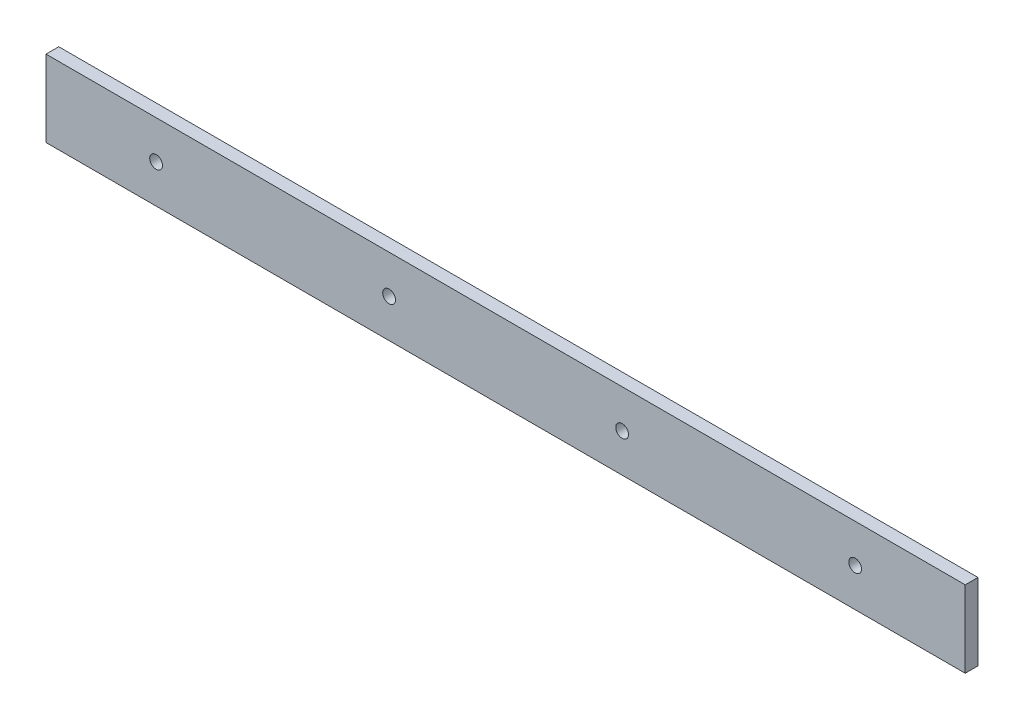
ISO-10303-21;
HEADER;
FILE_DESCRIPTION(('STEP AP214'),'2;1');
FILE_NAME('part.step','',(''),(''),'','','');
FILE_SCHEMA(('AUTOMOTIVE_DESIGN { 1 0 10303 214 1 1 1 1 }'));
ENDSEC;
DATA;
#1=APPLICATION_CONTEXT('core data for automotive mechanical design processes');
#2=APPLICATION_PROTOCOL_DEFINITION('international standard','automotive_design',2000,#1);
#3=PRODUCT_CONTEXT('',#1,'mechanical');
#4=PRODUCT('Part','Part','',(#3));
#5=PRODUCT_RELATED_PRODUCT_CATEGORY('part','',(#4));
#6=PRODUCT_DEFINITION_FORMATION('','',#4);
#7=PRODUCT_DEFINITION_CONTEXT('part definition',#1,'design');
#8=PRODUCT_DEFINITION('design','',#6,#7);
#9=PRODUCT_DEFINITION_SHAPE('','',#8);
#10=(LENGTH_UNIT() NAMED_UNIT(*) SI_UNIT(.MILLI.,.METRE.));
#11=(NAMED_UNIT(*) PLANE_ANGLE_UNIT() SI_UNIT($,.RADIAN.));
#12=(NAMED_UNIT(*) SI_UNIT($,.STERADIAN.) SOLID_ANGLE_UNIT());
#13=UNCERTAINTY_MEASURE_WITH_UNIT(LENGTH_MEASURE(1.E-05),#10,'distance_accuracy_value','');
#14=(GEOMETRIC_REPRESENTATION_CONTEXT(3) GLOBAL_UNCERTAINTY_ASSIGNED_CONTEXT((#13)) GLOBAL_UNIT_ASSIGNED_CONTEXT((#10,
#11,#12)) REPRESENTATION_CONTEXT('',''));
#15=CARTESIAN_POINT('',(0.,0.,0.));
#16=DIRECTION('',(0.,0.,1.));
#17=DIRECTION('',(1.,0.,0.));
#18=AXIS2_PLACEMENT_3D('',#15,#16,#17);
#19=CARTESIAN_POINT('',(0.,0.,6.35));
#20=DIRECTION('',(0.,0.,-1.));
#21=DIRECTION('',(-1.,0.,0.));
#22=AXIS2_PLACEMENT_3D('',#19,#20,#21);
#23=PLANE('',#22);
#24=DIRECTION('',(0.,-1.,0.));
#25=VECTOR('',#24,1.);
#26=CARTESIAN_POINT('',(0.,0.,6.35));
#27=LINE('',#26,#25);
#28=CARTESIAN_POINT('',(0.,38.1,6.35));
#29=VERTEX_POINT('',#28);
#30=CARTESIAN_POINT('',(0.,0.,6.35));
#31=VERTEX_POINT('',#30);
#32=EDGE_CURVE('E96',#29,#31,#27,.T.);
#33=ORIENTED_EDGE('',*,*,#32,.T.);
#34=DIRECTION('',(1.,0.,0.));
#35=VECTOR('',#34,1.);
#36=CARTESIAN_POINT('',(0.,0.,6.35));
#37=LINE('',#36,#35);
#38=CARTESIAN_POINT('',(457.2,0.,6.35));
#39=VERTEX_POINT('',#38);
#40=EDGE_CURVE('E90',#31,#39,#37,.T.);
#41=ORIENTED_EDGE('',*,*,#40,.T.);
#42=DIRECTION('',(0.,1.,0.));
#43=VECTOR('',#42,1.);
#44=CARTESIAN_POINT('',(457.2,0.,6.35));
#45=LINE('',#44,#43);
#46=CARTESIAN_POINT('',(457.2,38.1,6.35));
#47=VERTEX_POINT('',#46);
#48=EDGE_CURVE('E94',#39,#47,#45,.T.);
#49=ORIENTED_EDGE('',*,*,#48,.T.);
#50=DIRECTION('',(-1.,0.,0.));
#51=VECTOR('',#50,1.);
#52=CARTESIAN_POINT('',(0.,38.1,6.35));
#53=LINE('',#52,#51);
#54=EDGE_CURVE('E60',#47,#29,#53,.T.);
#55=ORIENTED_EDGE('',*,*,#54,.T.);
#56=EDGE_LOOP('',(#33,#41,#49,#55));
#57=FACE_BOUND('',#56,.T.);
#58=CARTESIAN_POINT('',(54.7497,19.05,6.35));
#59=DIRECTION('',(0.,0.,1.));
#60=DIRECTION('',(1.,0.,0.));
#61=AXIS2_PLACEMENT_3D('',#58,#59,#60);
#62=CIRCLE('',#61,3.175);
#63=CARTESIAN_POINT('',(57.9247,19.05,6.35));
#64=VERTEX_POINT('',#63);
#65=EDGE_CURVE('E115',#64,#64,#62,.T.);
#66=ORIENTED_EDGE('',*,*,#65,.F.);
#67=EDGE_LOOP('',(#66));
#68=FACE_BOUND('',#67,.T.);
#69=CARTESIAN_POINT('',(170.6499,19.05,6.35));
#70=DIRECTION('',(0.,0.,1.));
#71=DIRECTION('',(1.,0.,0.));
#72=AXIS2_PLACEMENT_3D('',#69,#70,#71);
#73=CIRCLE('',#72,3.17499999999997);
#74=CARTESIAN_POINT('',(173.8249,19.05,6.35));
#75=VERTEX_POINT('',#74);
#76=EDGE_CURVE('E132',#75,#75,#73,.T.);
#77=ORIENTED_EDGE('',*,*,#76,.F.);
#78=EDGE_LOOP('',(#77));
#79=FACE_BOUND('',#78,.T.);
#80=CARTESIAN_POINT('',(286.5501,19.05,6.35));
#81=DIRECTION('',(0.,0.,1.));
#82=DIRECTION('',(1.,0.,0.));
#83=AXIS2_PLACEMENT_3D('',#80,#81,#82);
#84=CIRCLE('',#83,3.17499999999997);
#85=CARTESIAN_POINT('',(289.7251,19.05,6.35));
#86=VERTEX_POINT('',#85);
#87=EDGE_CURVE('E139',#86,#86,#84,.T.);
#88=ORIENTED_EDGE('',*,*,#87,.F.);
#89=EDGE_LOOP('',(#88));
#90=FACE_BOUND('',#89,.T.);
#91=CARTESIAN_POINT('',(402.4503,19.05,6.35));
#92=DIRECTION('',(0.,0.,1.));
#93=DIRECTION('',(1.,0.,0.));
#94=AXIS2_PLACEMENT_3D('',#91,#92,#93);
#95=CIRCLE('',#94,3.17500000000003);
#96=CARTESIAN_POINT('',(405.6253,19.05,6.35));
#97=VERTEX_POINT('',#96);
#98=EDGE_CURVE('E145',#97,#97,#95,.T.);
#99=ORIENTED_EDGE('',*,*,#98,.F.);
#100=EDGE_LOOP('',(#99));
#101=FACE_BOUND('',#100,.T.);
#102=ADVANCED_FACE('F43',(#57,#68,#79,#90,#101),#23,.F.);
#103=CARTESIAN_POINT('',(0.,0.,0.));
#104=DIRECTION('',(0.,0.,-1.));
#105=DIRECTION('',(-1.,0.,0.));
#106=AXIS2_PLACEMENT_3D('',#103,#104,#105);
#107=PLANE('',#106);
#108=CARTESIAN_POINT('',(286.5501,19.05,0.));
#109=DIRECTION('',(0.,0.,1.));
#110=DIRECTION('',(1.,0.,0.));
#111=AXIS2_PLACEMENT_3D('',#108,#109,#110);
#112=CIRCLE('',#111,3.17499999999997);
#113=CARTESIAN_POINT('',(289.7251,19.05,0.));
#114=VERTEX_POINT('',#113);
#115=EDGE_CURVE('E142',#114,#114,#112,.T.);
#116=ORIENTED_EDGE('',*,*,#115,.T.);
#117=EDGE_LOOP('',(#116));
#118=FACE_BOUND('',#117,.T.);
#119=CARTESIAN_POINT('',(54.7497,19.05,0.));
#120=DIRECTION('',(0.,0.,1.));
#121=DIRECTION('',(1.,0.,0.));
#122=AXIS2_PLACEMENT_3D('',#119,#120,#121);
#123=CIRCLE('',#122,3.175);
#124=CARTESIAN_POINT('',(57.9247,19.05,0.));
#125=VERTEX_POINT('',#124);
#126=EDGE_CURVE('E129',#125,#125,#123,.T.);
#127=ORIENTED_EDGE('',*,*,#126,.T.);
#128=EDGE_LOOP('',(#127));
#129=FACE_BOUND('',#128,.T.);
#130=DIRECTION('',(0.,-1.,0.));
#131=VECTOR('',#130,1.);
#132=CARTESIAN_POINT('',(0.,0.,0.));
#133=LINE('',#132,#131);
#134=CARTESIAN_POINT('',(0.,38.1,0.));
#135=VERTEX_POINT('',#134);
#136=CARTESIAN_POINT('',(0.,0.,0.));
#137=VERTEX_POINT('',#136);
#138=EDGE_CURVE('E112',#135,#137,#133,.T.);
#139=ORIENTED_EDGE('',*,*,#138,.F.);
#140=DIRECTION('',(-1.,0.,0.));
#141=VECTOR('',#140,1.);
#142=CARTESIAN_POINT('',(0.,38.1,0.));
#143=LINE('',#142,#141);
#144=CARTESIAN_POINT('',(457.2,38.1,0.));
#145=VERTEX_POINT('',#144);
#146=EDGE_CURVE('E83',#145,#135,#143,.T.);
#147=ORIENTED_EDGE('',*,*,#146,.F.);
#148=DIRECTION('',(0.,1.,0.));
#149=VECTOR('',#148,1.);
#150=CARTESIAN_POINT('',(457.2,0.,0.));
#151=LINE('',#150,#149);
#152=CARTESIAN_POINT('',(457.2,0.,0.));
#153=VERTEX_POINT('',#152);
#154=EDGE_CURVE('E77',#153,#145,#151,.T.);
#155=ORIENTED_EDGE('',*,*,#154,.F.);
#156=DIRECTION('',(1.,0.,0.));
#157=VECTOR('',#156,1.);
#158=CARTESIAN_POINT('',(0.,0.,0.));
#159=LINE('',#158,#157);
#160=EDGE_CURVE('E101',#137,#153,#159,.T.);
#161=ORIENTED_EDGE('',*,*,#160,.F.);
#162=EDGE_LOOP('',(#139,#147,#155,#161));
#163=FACE_BOUND('',#162,.T.);
#164=CARTESIAN_POINT('',(170.6499,19.05,0.));
#165=DIRECTION('',(0.,0.,1.));
#166=DIRECTION('',(1.,0.,0.));
#167=AXIS2_PLACEMENT_3D('',#164,#165,#166);
#168=CIRCLE('',#167,3.17499999999997);
#169=CARTESIAN_POINT('',(173.8249,19.05,0.));
#170=VERTEX_POINT('',#169);
#171=EDGE_CURVE('E135',#170,#170,#168,.T.);
#172=ORIENTED_EDGE('',*,*,#171,.T.);
#173=EDGE_LOOP('',(#172));
#174=FACE_BOUND('',#173,.T.);
#175=CARTESIAN_POINT('',(402.4503,19.05,0.));
#176=DIRECTION('',(0.,0.,1.));
#177=DIRECTION('',(1.,0.,0.));
#178=AXIS2_PLACEMENT_3D('',#175,#176,#177);
#179=CIRCLE('',#178,3.17500000000003);
#180=CARTESIAN_POINT('',(405.6253,19.05,0.));
#181=VERTEX_POINT('',#180);
#182=EDGE_CURVE('E148',#181,#181,#179,.T.);
#183=ORIENTED_EDGE('',*,*,#182,.T.);
#184=EDGE_LOOP('',(#183));
#185=FACE_BOUND('',#184,.T.);
#186=ADVANCED_FACE('F125',(#118,#129,#163,#174,#185),#107,.T.);
#187=CARTESIAN_POINT('',(0.,0.,6.35));
#188=DIRECTION('',(1.,0.,0.));
#189=DIRECTION('',(0.,0.,-1.));
#190=AXIS2_PLACEMENT_3D('',#187,#188,#189);
#191=PLANE('',#190);
#192=ORIENTED_EDGE('',*,*,#138,.T.);
#193=DIRECTION('',(0.,0.,-1.));
#194=VECTOR('',#193,1.);
#195=CARTESIAN_POINT('',(0.,0.,6.35));
#196=LINE('',#195,#194);
#197=EDGE_CURVE('E11',#31,#137,#196,.T.);
#198=ORIENTED_EDGE('',*,*,#197,.F.);
#199=ORIENTED_EDGE('',*,*,#32,.F.);
#200=DIRECTION('',(0.,0.,-1.));
#201=VECTOR('',#200,1.);
#202=CARTESIAN_POINT('',(0.,38.1,6.35));
#203=LINE('',#202,#201);
#204=EDGE_CURVE('E108',#29,#135,#203,.T.);
#205=ORIENTED_EDGE('',*,*,#204,.T.);
#206=EDGE_LOOP('',(#192,#198,#199,#205));
#207=FACE_BOUND('',#206,.T.);
#208=ADVANCED_FACE('F45',(#207),#191,.F.);
#209=CARTESIAN_POINT('',(0.,0.,6.35));
#210=DIRECTION('',(0.,1.,0.));
#211=DIRECTION('',(0.,0.,1.));
#212=AXIS2_PLACEMENT_3D('',#209,#210,#211);
#213=PLANE('',#212);
#214=ORIENTED_EDGE('',*,*,#160,.T.);
#215=DIRECTION('',(0.,0.,-1.));
#216=VECTOR('',#215,1.);
#217=CARTESIAN_POINT('',(457.2,0.,6.35));
#218=LINE('',#217,#216);
#219=EDGE_CURVE('E52',#39,#153,#218,.T.);
#220=ORIENTED_EDGE('',*,*,#219,.F.);
#221=ORIENTED_EDGE('',*,*,#40,.F.);
#222=ORIENTED_EDGE('',*,*,#197,.T.);
#223=EDGE_LOOP('',(#214,#220,#221,#222));
#224=FACE_BOUND('',#223,.T.);
#225=ADVANCED_FACE('F100',(#224),#213,.F.);
#226=CARTESIAN_POINT('',(457.2,0.,6.35));
#227=DIRECTION('',(-1.,0.,0.));
#228=DIRECTION('',(0.,0.,1.));
#229=AXIS2_PLACEMENT_3D('',#226,#227,#228);
#230=PLANE('',#229);
#231=ORIENTED_EDGE('',*,*,#154,.T.);
#232=DIRECTION('',(0.,0.,-1.));
#233=VECTOR('',#232,1.);
#234=CARTESIAN_POINT('',(457.2,38.1,6.35));
#235=LINE('',#234,#233);
#236=EDGE_CURVE('E103',#47,#145,#235,.T.);
#237=ORIENTED_EDGE('',*,*,#236,.F.);
#238=ORIENTED_EDGE('',*,*,#48,.F.);
#239=ORIENTED_EDGE('',*,*,#219,.T.);
#240=EDGE_LOOP('',(#231,#237,#238,#239));
#241=FACE_BOUND('',#240,.T.);
#242=ADVANCED_FACE('F104',(#241),#230,.F.);
#243=CARTESIAN_POINT('',(0.,38.1,6.35));
#244=DIRECTION('',(0.,-1.,0.));
#245=DIRECTION('',(0.,0.,-1.));
#246=AXIS2_PLACEMENT_3D('',#243,#244,#245);
#247=PLANE('',#246);
#248=ORIENTED_EDGE('',*,*,#146,.T.);
#249=ORIENTED_EDGE('',*,*,#204,.F.);
#250=ORIENTED_EDGE('',*,*,#54,.F.);
#251=ORIENTED_EDGE('',*,*,#236,.T.);
#252=EDGE_LOOP('',(#248,#249,#250,#251));
#253=FACE_BOUND('',#252,.T.);
#254=ADVANCED_FACE('F122',(#253),#247,.F.);
#255=CARTESIAN_POINT('',(54.7497,19.05,6.35));
#256=DIRECTION('',(0.,0.,-1.));
#257=DIRECTION('',(-1.,0.,0.));
#258=AXIS2_PLACEMENT_3D('',#255,#256,#257);
#259=CYLINDRICAL_SURFACE('',#258,3.175);
#260=ORIENTED_EDGE('',*,*,#65,.T.);
#261=EDGE_LOOP('',(#260));
#262=FACE_BOUND('',#261,.T.);
#263=ORIENTED_EDGE('',*,*,#126,.F.);
#264=EDGE_LOOP('',(#263));
#265=FACE_BOUND('',#264,.T.);
#266=ADVANCED_FACE('F165',(#262,#265),#259,.F.);
#267=CARTESIAN_POINT('',(170.6499,19.05,6.35));
#268=DIRECTION('',(0.,0.,-1.));
#269=DIRECTION('',(-1.,0.,0.));
#270=AXIS2_PLACEMENT_3D('',#267,#268,#269);
#271=CYLINDRICAL_SURFACE('',#270,3.17499999999997);
#272=ORIENTED_EDGE('',*,*,#76,.T.);
#273=EDGE_LOOP('',(#272));
#274=FACE_BOUND('',#273,.T.);
#275=ORIENTED_EDGE('',*,*,#171,.F.);
#276=EDGE_LOOP('',(#275));
#277=FACE_BOUND('',#276,.T.);
#278=ADVANCED_FACE('F210',(#274,#277),#271,.F.);
#279=CARTESIAN_POINT('',(286.5501,19.05,6.35));
#280=DIRECTION('',(0.,0.,-1.));
#281=DIRECTION('',(-1.,0.,0.));
#282=AXIS2_PLACEMENT_3D('',#279,#280,#281);
#283=CYLINDRICAL_SURFACE('',#282,3.17499999999997);
#284=ORIENTED_EDGE('',*,*,#87,.T.);
#285=EDGE_LOOP('',(#284));
#286=FACE_BOUND('',#285,.T.);
#287=ORIENTED_EDGE('',*,*,#115,.F.);
#288=EDGE_LOOP('',(#287));
#289=FACE_BOUND('',#288,.T.);
#290=ADVANCED_FACE('F218',(#286,#289),#283,.F.);
#291=CARTESIAN_POINT('',(402.4503,19.05,6.35));
#292=DIRECTION('',(0.,0.,-1.));
#293=DIRECTION('',(-1.,0.,0.));
#294=AXIS2_PLACEMENT_3D('',#291,#292,#293);
#295=CYLINDRICAL_SURFACE('',#294,3.17500000000003);
#296=ORIENTED_EDGE('',*,*,#98,.T.);
#297=EDGE_LOOP('',(#296));
#298=FACE_BOUND('',#297,.T.);
#299=ORIENTED_EDGE('',*,*,#182,.F.);
#300=EDGE_LOOP('',(#299));
#301=FACE_BOUND('',#300,.T.);
#302=ADVANCED_FACE('F154',(#298,#301),#295,.F.);
#303=CLOSED_SHELL('',(#102,#186,#208,#225,#242,#254,#266,#278,#290,#302));
#304=MANIFOLD_SOLID_BREP('B2',#303);
#305=ADVANCED_BREP_SHAPE_REPRESENTATION('',(#18,#304),#14);
#306=SHAPE_DEFINITION_REPRESENTATION(#9,#305);
ENDSEC;
END-ISO-10303-21;
